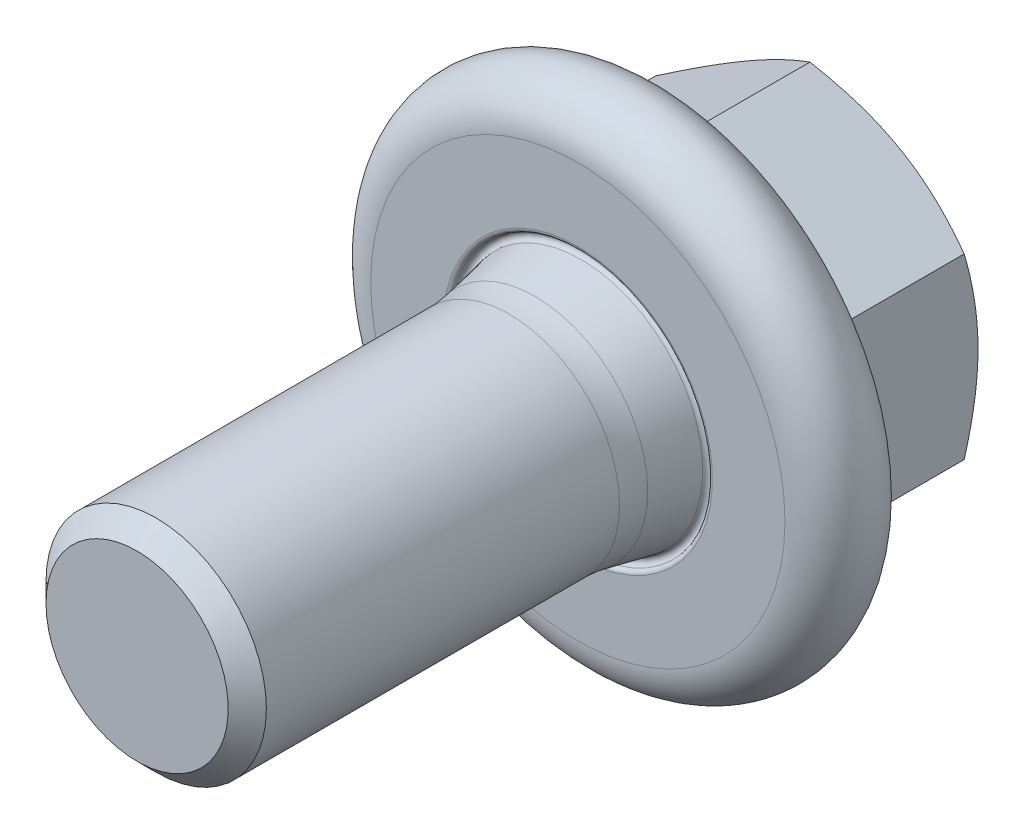
ISO-10303-21;
HEADER;
FILE_DESCRIPTION(('STEP AP214'),'2;1');
FILE_NAME('part.step','',(''),(''),'','','');
FILE_SCHEMA(('AUTOMOTIVE_DESIGN { 1 0 10303 214 1 1 1 1 }'));
ENDSEC;
DATA;
#1=APPLICATION_CONTEXT('core data for automotive mechanical design processes');
#2=APPLICATION_PROTOCOL_DEFINITION('international standard','automotive_design',2000,#1);
#3=PRODUCT_CONTEXT('',#1,'mechanical');
#4=PRODUCT('Part','Part','',(#3));
#5=PRODUCT_RELATED_PRODUCT_CATEGORY('part','',(#4));
#6=PRODUCT_DEFINITION_FORMATION('','',#4);
#7=PRODUCT_DEFINITION_CONTEXT('part definition',#1,'design');
#8=PRODUCT_DEFINITION('design','',#6,#7);
#9=PRODUCT_DEFINITION_SHAPE('','',#8);
#10=(LENGTH_UNIT() NAMED_UNIT(*) SI_UNIT(.MILLI.,.METRE.));
#11=(NAMED_UNIT(*) PLANE_ANGLE_UNIT() SI_UNIT($,.RADIAN.));
#12=(NAMED_UNIT(*) SI_UNIT($,.STERADIAN.) SOLID_ANGLE_UNIT());
#13=UNCERTAINTY_MEASURE_WITH_UNIT(LENGTH_MEASURE(1.E-05),#10,'distance_accuracy_value','');
#14=(GEOMETRIC_REPRESENTATION_CONTEXT(3) GLOBAL_UNCERTAINTY_ASSIGNED_CONTEXT((#13)) GLOBAL_UNIT_ASSIGNED_CONTEXT((#10,
#11,#12)) REPRESENTATION_CONTEXT('',''));
#15=CARTESIAN_POINT('',(0.,0.,0.));
#16=DIRECTION('',(0.,0.,1.));
#17=DIRECTION('',(1.,0.,0.));
#18=AXIS2_PLACEMENT_3D('',#15,#16,#17);
#19=CARTESIAN_POINT('',(241.672364397832,223.144870532736,-56.8712423991404));
#20=DIRECTION('',(-0.5,0.866025403784439,0.));
#21=DIRECTION('',(-0.866025403784439,-0.5,0.));
#22=AXIS2_PLACEMENT_3D('',#19,#20,#21);
#23=PLANE('',#22);
#24=CARTESIAN_POINT('',(243.422364397832,224.155233503818,-55.8751120835531));
#25=CARTESIAN_POINT('',(243.277421681038,224.07155078726,-55.9055801190428));
#26=CARTESIAN_POINT('',(243.132001035496,223.98759213841,-55.933295966667));
#27=CARTESIAN_POINT('',(242.840214294002,223.819128984663,-55.9820575852273));
#28=CARTESIAN_POINT('',(242.693847549201,223.734624105151,-56.0030981378447));
#29=CARTESIAN_POINT('',(242.40179278474,223.566006208272,-56.0371305831336));
#30=CARTESIAN_POINT('',(242.256111433559,223.481897040951,-56.0501966988537));
#31=CARTESIAN_POINT('',(241.964408088679,223.313482036261,-56.0677220203163));
#32=CARTESIAN_POINT('',(241.818386243255,223.229176284499,-56.0721844527356));
#33=CARTESIAN_POINT('',(241.526342552409,223.060564780973,-56.0721844527356));
#34=CARTESIAN_POINT('',(241.380320706985,222.97625902921,-56.0677220203164));
#35=CARTESIAN_POINT('',(241.088617362105,222.807844024521,-56.0501966988537));
#36=CARTESIAN_POINT('',(240.942936010924,222.7237348572,-56.0371305831336));
#37=CARTESIAN_POINT('',(240.650881246463,222.555116960321,-56.0030981378448));
#38=CARTESIAN_POINT('',(240.504514501662,222.470612080809,-55.9820575852274));
#39=CARTESIAN_POINT('',(240.212727760168,222.302148927062,-55.9332959666671));
#40=CARTESIAN_POINT('',(240.067307114626,222.218190278212,-55.9055801190429));
#41=CARTESIAN_POINT('',(239.922364397832,222.134507561654,-55.8751120835531));
#42=B_SPLINE_CURVE_WITH_KNOTS('',3,(#24,#25,#26,#27,#28,#29,#30,#31,#32,#33,#34,#35,#36,#37,#38,
#39,#40,#41),.UNSPECIFIED.,.F.,.F.,(4,2,2,2,2,2,2,2,4),(0.,0.51040094831921,1.02119991788177,
1.52716902069214,2.03294833077726,2.53872764086244,3.04469674367278,3.55549571323536,
4.06589666155457),.UNSPECIFIED.);
#43=CARTESIAN_POINT('',(243.422364397832,224.155233503818,-55.875112083553));
#44=VERTEX_POINT('',#43);
#45=CARTESIAN_POINT('',(239.922364397832,222.134507561654,-55.8751120835532));
#46=VERTEX_POINT('',#45);
#47=EDGE_CURVE('E41',#44,#46,#42,.T.);
#48=ORIENTED_EDGE('',*,*,#47,.F.);
#49=DIRECTION('',(0.,0.,-1.));
#50=VECTOR('',#49,1.);
#51=CARTESIAN_POINT('',(243.422364397832,224.155233503818,-54.5712423991404));
#52=LINE('',#51,#50);
#53=CARTESIAN_POINT('',(243.422364397832,224.155233503818,-58.8384277485488));
#54=VERTEX_POINT('',#53);
#55=EDGE_CURVE('E11',#44,#54,#52,.T.);
#56=ORIENTED_EDGE('',*,*,#55,.T.);
#57=CARTESIAN_POINT('',(243.422364397832,224.155233503818,-58.8384277485489));
#58=CARTESIAN_POINT('',(243.268560594597,224.066434836618,-58.8897105445773));
#59=CARTESIAN_POINT('',(243.11342915912,223.976869660585,-58.9363495636235));
#60=CARTESIAN_POINT('',(242.800480291131,223.796188547409,-59.0177565705984));
#61=CARTESIAN_POINT('',(242.642657299934,223.705069400957,-59.0524957629572));
#62=CARTESIAN_POINT('',(242.328967138754,223.523960301958,-59.1065698203933));
#63=CARTESIAN_POINT('',(242.173148220503,223.433998207561,-59.1262646202544));
#64=CARTESIAN_POINT('',(241.860777587023,223.253650938235,-59.1497717043207));
#65=CARTESIAN_POINT('',(241.704227006398,223.163266418368,-59.1536034590941));
#66=CARTESIAN_POINT('',(241.41172904084,222.994392639216,-59.1456117407781));
#67=CARTESIAN_POINT('',(241.275737764205,222.915878039044,-59.1357504994205));
#68=CARTESIAN_POINT('',(241.004641149744,222.759360335708,-59.1045024722922));
#69=CARTESIAN_POINT('',(240.869536748868,222.681357773494,-59.0831050227038));
#70=CARTESIAN_POINT('',(240.597881649814,222.524517628928,-59.0296155402069));
#71=CARTESIAN_POINT('',(240.461365315911,222.4456998868,-58.997296874667));
#72=CARTESIAN_POINT('',(240.190368200323,222.289239629166,-58.9239471670801));
#73=CARTESIAN_POINT('',(240.055883949531,222.21159511077,-58.8829333482326));
#74=CARTESIAN_POINT('',(239.922364397832,222.134507561654,-58.838427748549));
#75=B_SPLINE_CURVE_WITH_KNOTS('',3,(#57,#58,#59,#60,#61,#62,#63,#64,#65,#66,#67,#68,#69,#70,#71,
#72,#73,#74),.UNSPECIFIED.,.F.,.F.,(4,2,2,2,2,2,2,2,4),(0.,0.55477802022457,1.11088917979753,
1.65323831076775,2.19492155557138,2.666488619606,3.1384923391404,3.62096283935536,
4.10248645365132),.UNSPECIFIED.);
#76=CARTESIAN_POINT('',(239.922364397832,222.134507561654,-58.838427748549));
#77=VERTEX_POINT('',#76);
#78=EDGE_CURVE('E33',#54,#77,#75,.T.);
#79=ORIENTED_EDGE('',*,*,#78,.T.);
#80=DIRECTION('',(0.,0.,-1.));
#81=VECTOR('',#80,1.);
#82=CARTESIAN_POINT('',(239.922364397832,222.134507561654,-54.5712423991404));
#83=LINE('',#82,#81);
#84=EDGE_CURVE('E148',#46,#77,#83,.T.);
#85=ORIENTED_EDGE('',*,*,#84,.F.);
#86=EDGE_LOOP('',(#48,#56,#79,#85));
#87=FACE_BOUND('',#86,.T.);
#88=ADVANCED_FACE('F17',(#87),#23,.T.);
#89=CARTESIAN_POINT('',(239.922364397832,220.11378161949,-56.8712423991404));
#90=DIRECTION('',(-1.,0.,0.));
#91=DIRECTION('',(0.,-1.,0.));
#92=AXIS2_PLACEMENT_3D('',#89,#90,#91);
#93=PLANE('',#92);
#94=CARTESIAN_POINT('',(239.922364397832,222.134507561654,-55.8751120835532));
#95=CARTESIAN_POINT('',(239.922364397832,221.967142128538,-55.9055801190429));
#96=CARTESIAN_POINT('',(239.922364397832,221.799224830839,-55.9332959666672));
#97=CARTESIAN_POINT('',(239.922364397832,221.462298523344,-55.9820575852274));
#98=CARTESIAN_POINT('',(239.922364397832,221.293288764321,-56.0030981378448));
#99=CARTESIAN_POINT('',(239.922364397832,220.956052970562,-56.0371305831337));
#100=CARTESIAN_POINT('',(239.922364397832,220.787834635921,-56.0501966988538));
#101=CARTESIAN_POINT('',(239.922364397832,220.451004626542,-56.0677220203165));
#102=CARTESIAN_POINT('',(239.922364397832,220.282393123016,-56.0721844527357));
#103=CARTESIAN_POINT('',(239.922364397832,219.945170115965,-56.0721844527358));
#104=CARTESIAN_POINT('',(239.922364397832,219.77655861244,-56.0677220203165));
#105=CARTESIAN_POINT('',(239.922364397832,219.43972860306,-56.0501966988539));
#106=CARTESIAN_POINT('',(239.922364397832,219.271510268419,-56.0371305831338));
#107=CARTESIAN_POINT('',(239.922364397832,218.93427447466,-56.003098137845));
#108=CARTESIAN_POINT('',(239.922364397832,218.765264715637,-55.9820575852276));
#109=CARTESIAN_POINT('',(239.922364397832,218.428338408142,-55.9332959666673));
#110=CARTESIAN_POINT('',(239.922364397832,218.260421110443,-55.9055801190431));
#111=CARTESIAN_POINT('',(239.922364397832,218.093055677327,-55.8751120835534));
#112=B_SPLINE_CURVE_WITH_KNOTS('',3,(#94,#95,#96,#97,#98,#99,#100,#101,#102,#103,#104,#105,#106,
#107,#108,#109,#110,#111),.UNSPECIFIED.,.F.,.F.,(4,2,2,2,2,2,2,2,4),(0.,0.510400948319135,
1.02119991788164,1.52716902069194,2.03294833077701,2.53872764086205,3.04469674367237,
3.55549571323487,4.06589666155403),.UNSPECIFIED.);
#113=CARTESIAN_POINT('',(239.922364397832,218.093055677327,-55.8751120835534));
#114=VERTEX_POINT('',#113);
#115=EDGE_CURVE('E255',#46,#114,#112,.T.);
#116=ORIENTED_EDGE('',*,*,#115,.F.);
#117=ORIENTED_EDGE('',*,*,#84,.T.);
#118=CARTESIAN_POINT('',(239.922364397832,222.134507561654,-58.8384277485491));
#119=CARTESIAN_POINT('',(239.922364397832,221.956910227253,-58.8897105445775));
#120=CARTESIAN_POINT('',(239.922364397832,221.777779875189,-58.9363495636237));
#121=CARTESIAN_POINT('',(239.922364397832,221.416417648837,-59.0177565705986));
#122=CARTESIAN_POINT('',(239.922364397832,221.234179355933,-59.0524957629575));
#123=CARTESIAN_POINT('',(239.922364397832,220.871961157934,-59.1065698203935));
#124=CARTESIAN_POINT('',(239.922364397832,220.69203696914,-59.1262646202546));
#125=CARTESIAN_POINT('',(239.922364397832,220.331342430487,-59.1497717043209));
#126=CARTESIAN_POINT('',(239.922364397832,220.150573390755,-59.1536034590943));
#127=CARTESIAN_POINT('',(239.922364397832,219.812825832451,-59.1456117407783));
#128=CARTESIAN_POINT('',(239.922364397832,219.655796632106,-59.1357504994208));
#129=CARTESIAN_POINT('',(239.922364397832,219.342761225434,-59.1045024722925));
#130=CARTESIAN_POINT('',(239.922364397832,219.186756101006,-59.0831050227041));
#131=CARTESIAN_POINT('',(239.922364397832,218.873075811875,-59.0296155402072));
#132=CARTESIAN_POINT('',(239.922364397832,218.715440327619,-58.9972968746672));
#133=CARTESIAN_POINT('',(239.922364397832,218.402519812351,-58.9239471670804));
#134=CARTESIAN_POINT('',(239.922364397832,218.247230775558,-58.882933348233));
#135=CARTESIAN_POINT('',(239.922364397832,218.093055677327,-58.8384277485493));
#136=B_SPLINE_CURVE_WITH_KNOTS('',3,(#118,#119,#120,#121,#122,#123,#124,#125,#126,#127,#128,
#129,#130,#131,#132,#133,#134,#135),.UNSPECIFIED.,.F.,.F.,(4,2,2,2,2,2,2,2,4),(0.,
0.554778020224541,1.11088917979754,1.65323831076774,2.19492155557138,2.66648861960586,
3.13849233914015,3.62096283935494,4.10248645365079),.UNSPECIFIED.);
#137=CARTESIAN_POINT('',(239.922364397832,218.093055677327,-58.8384277485494));
#138=VERTEX_POINT('',#137);
#139=EDGE_CURVE('E150',#77,#138,#136,.T.);
#140=ORIENTED_EDGE('',*,*,#139,.T.);
#141=DIRECTION('',(0.,0.,-1.));
#142=VECTOR('',#141,1.);
#143=CARTESIAN_POINT('',(239.922364397832,218.093055677327,-54.5712423991404));
#144=LINE('',#143,#142);
#145=EDGE_CURVE('E159',#114,#138,#144,.T.);
#146=ORIENTED_EDGE('',*,*,#145,.F.);
#147=EDGE_LOOP('',(#116,#117,#140,#146));
#148=FACE_BOUND('',#147,.T.);
#149=ADVANCED_FACE('F260',(#148),#93,.T.);
#150=CARTESIAN_POINT('',(241.672364397832,217.082692706245,-56.8712423991404));
#151=DIRECTION('',(-0.5,-0.866025403784439,0.));
#152=DIRECTION('',(0.866025403784439,-0.5,0.));
#153=AXIS2_PLACEMENT_3D('',#150,#151,#152);
#154=PLANE('',#153);
#155=CARTESIAN_POINT('',(239.922364397832,218.093055677327,-55.8751120835533));
#156=CARTESIAN_POINT('',(240.067307114626,218.009372960769,-55.9055801190431));
#157=CARTESIAN_POINT('',(240.212727760168,217.925414311919,-55.9332959666673));
#158=CARTESIAN_POINT('',(240.504514501662,217.756951158172,-55.9820575852276));
#159=CARTESIAN_POINT('',(240.650881246463,217.67244627866,-56.003098137845));
#160=CARTESIAN_POINT('',(240.942936010924,217.503828381781,-56.0371305831339));
#161=CARTESIAN_POINT('',(241.088617362105,217.41971921446,-56.050196698854));
#162=CARTESIAN_POINT('',(241.380320706985,217.251304209771,-56.0677220203167));
#163=CARTESIAN_POINT('',(241.526342552409,217.166998458008,-56.0721844527359));
#164=CARTESIAN_POINT('',(241.818386243255,216.998386954482,-56.0721844527359));
#165=CARTESIAN_POINT('',(241.964408088679,216.91408120272,-56.0677220203167));
#166=CARTESIAN_POINT('',(242.256111433559,216.74566619803,-56.050196698854));
#167=CARTESIAN_POINT('',(242.40179278474,216.661557030709,-56.0371305831339));
#168=CARTESIAN_POINT('',(242.693847549201,216.49293913383,-56.0030981378451));
#169=CARTESIAN_POINT('',(242.840214294002,216.408434254318,-55.9820575852277));
#170=CARTESIAN_POINT('',(243.132001035496,216.239971100571,-55.9332959666674));
#171=CARTESIAN_POINT('',(243.277421681038,216.156012451721,-55.9055801190432));
#172=CARTESIAN_POINT('',(243.422364397832,216.072329735163,-55.8751120835534));
#173=B_SPLINE_CURVE_WITH_KNOTS('',3,(#155,#156,#157,#158,#159,#160,#161,#162,#163,#164,#165,
#166,#167,#168,#169,#170,#171,#172),.UNSPECIFIED.,.F.,.F.,(4,2,2,2,2,2,2,2,4),(0.,
0.510400948319224,1.02119991788179,1.52716902069215,2.03294833077728,2.53872764086245,
3.0446967436728,3.55549571323538,4.06589666155458),.UNSPECIFIED.);
#174=CARTESIAN_POINT('',(243.422364397832,216.072329735163,-55.8751120835534));
#175=VERTEX_POINT('',#174);
#176=EDGE_CURVE('E228',#114,#175,#173,.T.);
#177=ORIENTED_EDGE('',*,*,#176,.F.);
#178=ORIENTED_EDGE('',*,*,#145,.T.);
#179=CARTESIAN_POINT('',(239.922364397832,218.093055677327,-58.8384277485493));
#180=CARTESIAN_POINT('',(240.076168201067,218.004257010127,-58.8897105445777));
#181=CARTESIAN_POINT('',(240.231299636544,217.914691834094,-58.9363495636239));
#182=CARTESIAN_POINT('',(240.544248504533,217.734010720918,-59.0177565705989));
#183=CARTESIAN_POINT('',(240.70207149573,217.642891574466,-59.0524957629577));
#184=CARTESIAN_POINT('',(241.01576165691,217.461782475467,-59.1065698203938));
#185=CARTESIAN_POINT('',(241.171580575161,217.37182038107,-59.1262646202548));
#186=CARTESIAN_POINT('',(241.48395120864,217.191473111744,-59.1497717043212));
#187=CARTESIAN_POINT('',(241.640501789266,217.101088591878,-59.1536034590946));
#188=CARTESIAN_POINT('',(241.932999754824,216.932214812726,-59.1456117407786));
#189=CARTESIAN_POINT('',(242.068991031459,216.853700212553,-59.135750499421));
#190=CARTESIAN_POINT('',(242.34008764592,216.697182509217,-59.1045024722927));
#191=CARTESIAN_POINT('',(242.475192046796,216.619179947003,-59.0831050227043));
#192=CARTESIAN_POINT('',(242.74684714585,216.462339802437,-59.0296155402074));
#193=CARTESIAN_POINT('',(242.883363479753,216.383522060309,-58.9972968746674));
#194=CARTESIAN_POINT('',(243.154360595341,216.227061802675,-58.9239471670806));
#195=CARTESIAN_POINT('',(243.288844846133,216.149417284279,-58.8829333482331));
#196=CARTESIAN_POINT('',(243.422364397832,216.072329735163,-58.8384277485494));
#197=B_SPLINE_CURVE_WITH_KNOTS('',3,(#179,#180,#181,#182,#183,#184,#185,#186,#187,#188,#189,
#190,#191,#192,#193,#194,#195,#196),.UNSPECIFIED.,.F.,.F.,(4,2,2,2,2,2,2,2,4),(0.,
0.554778020224543,1.11088917979746,1.6532383107676,2.19492155557119,2.66648861960582,
3.13849233914029,3.62096283935528,4.10248645365136),.UNSPECIFIED.);
#198=CARTESIAN_POINT('',(243.422364397832,216.072329735163,-58.8384277485494));
#199=VERTEX_POINT('',#198);
#200=EDGE_CURVE('E158',#138,#199,#197,.T.);
#201=ORIENTED_EDGE('',*,*,#200,.T.);
#202=DIRECTION('',(0.,0.,-1.));
#203=VECTOR('',#202,1.);
#204=CARTESIAN_POINT('',(243.422364397832,216.072329735163,-54.5712423991404));
#205=LINE('',#204,#203);
#206=EDGE_CURVE('E156',#175,#199,#205,.T.);
#207=ORIENTED_EDGE('',*,*,#206,.F.);
#208=EDGE_LOOP('',(#177,#178,#201,#207));
#209=FACE_BOUND('',#208,.T.);
#210=ADVANCED_FACE('F219',(#209),#154,.T.);
#211=CARTESIAN_POINT('',(245.172364397832,217.082692706245,-56.8712423991404));
#212=DIRECTION('',(0.5,-0.866025403784439,0.));
#213=DIRECTION('',(0.866025403784439,0.5,0.));
#214=AXIS2_PLACEMENT_3D('',#211,#212,#213);
#215=PLANE('',#214);
#216=CARTESIAN_POINT('',(243.422364397832,216.072329735163,-55.8751120835534));
#217=CARTESIAN_POINT('',(243.567307114626,216.156012451721,-55.9055801190432));
#218=CARTESIAN_POINT('',(243.712727760168,216.239971100571,-55.9332959666674));
#219=CARTESIAN_POINT('',(244.004514501662,216.408434254318,-55.9820575852277));
#220=CARTESIAN_POINT('',(244.150881246463,216.49293913383,-56.0030981378451));
#221=CARTESIAN_POINT('',(244.442936010924,216.661557030709,-56.0371305831339));
#222=CARTESIAN_POINT('',(244.588617362105,216.74566619803,-56.050196698854));
#223=CARTESIAN_POINT('',(244.880320706985,216.91408120272,-56.0677220203167));
#224=CARTESIAN_POINT('',(245.026342552409,216.998386954482,-56.0721844527359));
#225=CARTESIAN_POINT('',(245.318386243255,217.166998458008,-56.0721844527359));
#226=CARTESIAN_POINT('',(245.464408088679,217.251304209771,-56.0677220203167));
#227=CARTESIAN_POINT('',(245.756111433559,217.41971921446,-56.050196698854));
#228=CARTESIAN_POINT('',(245.90179278474,217.503828381781,-56.0371305831339));
#229=CARTESIAN_POINT('',(246.193847549201,217.67244627866,-56.003098137845));
#230=CARTESIAN_POINT('',(246.340214294002,217.756951158172,-55.9820575852276));
#231=CARTESIAN_POINT('',(246.632001035496,217.925414311919,-55.9332959666673));
#232=CARTESIAN_POINT('',(246.777421681038,218.009372960769,-55.9055801190431));
#233=CARTESIAN_POINT('',(246.922364397832,218.093055677327,-55.8751120835533));
#234=B_SPLINE_CURVE_WITH_KNOTS('',3,(#216,#217,#218,#219,#220,#221,#222,#223,#224,#225,#226,
#227,#228,#229,#230,#231,#232,#233),.UNSPECIFIED.,.F.,.F.,(4,2,2,2,2,2,2,2,4),(0.,
0.510400948319207,1.02119991788178,1.52716902069213,2.0329483307773,2.53872764086243,
3.04469674367279,3.55549571323536,4.06589666155458),.UNSPECIFIED.);
#235=CARTESIAN_POINT('',(246.922364397832,218.093055677327,-55.8751120835534));
#236=VERTEX_POINT('',#235);
#237=EDGE_CURVE('E64',#175,#236,#234,.T.);
#238=ORIENTED_EDGE('',*,*,#237,.F.);
#239=ORIENTED_EDGE('',*,*,#206,.T.);
#240=CARTESIAN_POINT('',(243.422364397832,216.072329735163,-58.8384277485494));
#241=CARTESIAN_POINT('',(243.576168201067,216.161128402363,-58.8897105445778));
#242=CARTESIAN_POINT('',(243.731299636544,216.250693578396,-58.9363495636241));
#243=CARTESIAN_POINT('',(244.044248504533,216.431374691571,-59.017756570599));
#244=CARTESIAN_POINT('',(244.20207149573,216.522493838024,-59.0524957629578));
#245=CARTESIAN_POINT('',(244.51576165691,216.703602937023,-59.1065698203938));
#246=CARTESIAN_POINT('',(244.67158057516,216.79356503142,-59.1262646202549));
#247=CARTESIAN_POINT('',(244.98395120864,216.973912300746,-59.1497717043212));
#248=CARTESIAN_POINT('',(245.140501789266,217.064296820612,-59.1536034590946));
#249=CARTESIAN_POINT('',(245.432999754824,217.233170599764,-59.1456117407786));
#250=CARTESIAN_POINT('',(245.568991031458,217.311685199937,-59.135750499421));
#251=CARTESIAN_POINT('',(245.84008764592,217.468202903273,-59.1045024722927));
#252=CARTESIAN_POINT('',(245.975192046796,217.546205465487,-59.0831050227043));
#253=CARTESIAN_POINT('',(246.24684714585,217.703045610053,-59.0296155402073));
#254=CARTESIAN_POINT('',(246.383363479753,217.78186335218,-58.9972968746673));
#255=CARTESIAN_POINT('',(246.654360595341,217.938323609815,-58.9239471670805));
#256=CARTESIAN_POINT('',(246.788844846133,218.015968128211,-58.882933348233));
#257=CARTESIAN_POINT('',(246.922364397832,218.093055677327,-58.8384277485493));
#258=B_SPLINE_CURVE_WITH_KNOTS('',3,(#240,#241,#242,#243,#244,#245,#246,#247,#248,#249,#250,
#251,#252,#253,#254,#255,#256,#257),.UNSPECIFIED.,.F.,.F.,(4,2,2,2,2,2,2,2,4),(0.,
0.554778020224408,1.11088917979724,1.6532383107673,2.19492155557072,2.6664886196055,
3.13849233914005,3.62096283935517,4.10248645365136),.UNSPECIFIED.);
#259=CARTESIAN_POINT('',(246.922364397832,218.093055677327,-58.8384277485493));
#260=VERTEX_POINT('',#259);
#261=EDGE_CURVE('E155',#199,#260,#258,.T.);
#262=ORIENTED_EDGE('',*,*,#261,.T.);
#263=DIRECTION('',(0.,0.,-1.));
#264=VECTOR('',#263,1.);
#265=CARTESIAN_POINT('',(246.922364397832,218.093055677327,-54.5712423991404));
#266=LINE('',#265,#264);
#267=EDGE_CURVE('E153',#236,#260,#266,.T.);
#268=ORIENTED_EDGE('',*,*,#267,.F.);
#269=EDGE_LOOP('',(#238,#239,#262,#268));
#270=FACE_BOUND('',#269,.T.);
#271=ADVANCED_FACE('F214',(#270),#215,.T.);
#272=CARTESIAN_POINT('',(246.922364397832,220.11378161949,-56.8712423991404));
#273=DIRECTION('',(1.,0.,0.));
#274=DIRECTION('',(0.,1.,0.));
#275=AXIS2_PLACEMENT_3D('',#272,#273,#274);
#276=PLANE('',#275);
#277=CARTESIAN_POINT('',(246.922364397832,218.093055677327,-55.8751120835534));
#278=CARTESIAN_POINT('',(246.922364397832,218.260421110443,-55.9055801190431));
#279=CARTESIAN_POINT('',(246.922364397832,218.428338408142,-55.9332959666673));
#280=CARTESIAN_POINT('',(246.922364397832,218.765264715637,-55.9820575852276));
#281=CARTESIAN_POINT('',(246.922364397832,218.93427447466,-56.003098137845));
#282=CARTESIAN_POINT('',(246.922364397832,219.271510268419,-56.0371305831338));
#283=CARTESIAN_POINT('',(246.922364397832,219.43972860306,-56.0501966988539));
#284=CARTESIAN_POINT('',(246.922364397832,219.77655861244,-56.0677220203165));
#285=CARTESIAN_POINT('',(246.922364397832,219.945170115965,-56.0721844527358));
#286=CARTESIAN_POINT('',(246.922364397832,220.282393123016,-56.0721844527357));
#287=CARTESIAN_POINT('',(246.922364397832,220.451004626542,-56.0677220203165));
#288=CARTESIAN_POINT('',(246.922364397832,220.787834635921,-56.0501966988538));
#289=CARTESIAN_POINT('',(246.922364397832,220.956052970562,-56.0371305831337));
#290=CARTESIAN_POINT('',(246.922364397832,221.293288764321,-56.0030981378448));
#291=CARTESIAN_POINT('',(246.922364397832,221.462298523344,-55.9820575852274));
#292=CARTESIAN_POINT('',(246.922364397832,221.799224830839,-55.9332959666672));
#293=CARTESIAN_POINT('',(246.922364397832,221.967142128538,-55.9055801190429));
#294=CARTESIAN_POINT('',(246.922364397832,222.134507561654,-55.8751120835532));
#295=B_SPLINE_CURVE_WITH_KNOTS('',3,(#277,#278,#279,#280,#281,#282,#283,#284,#285,#286,#287,
#288,#289,#290,#291,#292,#293,#294),.UNSPECIFIED.,.F.,.F.,(4,2,2,2,2,2,2,2,4),(0.,
0.510400948319099,1.02119991788166,1.52716902069197,2.03294833077702,2.53872764086209,
3.04469674367238,3.55549571323489,4.06589666155403),.UNSPECIFIED.);
#296=CARTESIAN_POINT('',(246.922364397832,222.134507561654,-55.8751120835532));
#297=VERTEX_POINT('',#296);
#298=EDGE_CURVE('E21',#236,#297,#295,.T.);
#299=ORIENTED_EDGE('',*,*,#298,.F.);
#300=ORIENTED_EDGE('',*,*,#267,.T.);
#301=CARTESIAN_POINT('',(246.922364397832,218.093055677327,-58.8384277485493));
#302=CARTESIAN_POINT('',(246.922364397832,218.270653011728,-58.8897105445777));
#303=CARTESIAN_POINT('',(246.922364397832,218.449783363792,-58.9363495636239));
#304=CARTESIAN_POINT('',(246.922364397832,218.811145590144,-59.0177565705988));
#305=CARTESIAN_POINT('',(246.922364397832,218.993383883048,-59.0524957629576));
#306=CARTESIAN_POINT('',(246.922364397832,219.355602081047,-59.1065698203936));
#307=CARTESIAN_POINT('',(246.922364397832,219.53552626984,-59.1262646202546));
#308=CARTESIAN_POINT('',(246.922364397832,219.896220808493,-59.1497717043209));
#309=CARTESIAN_POINT('',(246.922364397832,220.076989848225,-59.1536034590943));
#310=CARTESIAN_POINT('',(246.922364397832,220.41473740653,-59.1456117407783));
#311=CARTESIAN_POINT('',(246.922364397832,220.571766606875,-59.1357504994207));
#312=CARTESIAN_POINT('',(246.922364397832,220.884802013546,-59.1045024722924));
#313=CARTESIAN_POINT('',(246.922364397832,221.040807137975,-59.083105022704));
#314=CARTESIAN_POINT('',(246.922364397832,221.354487427106,-59.029615540207));
#315=CARTESIAN_POINT('',(246.922364397832,221.512122911362,-58.9972968746671));
#316=CARTESIAN_POINT('',(246.922364397832,221.825043426629,-58.9239471670802));
#317=CARTESIAN_POINT('',(246.922364397832,221.980332463423,-58.8829333482327));
#318=CARTESIAN_POINT('',(246.922364397832,222.134507561654,-58.8384277485491));
#319=B_SPLINE_CURVE_WITH_KNOTS('',3,(#301,#302,#303,#304,#305,#306,#307,#308,#309,#310,#311,
#312,#313,#314,#315,#316,#317,#318),.UNSPECIFIED.,.F.,.F.,(4,2,2,2,2,2,2,2,4),(0.,
0.554778020224406,1.11088917979725,1.65323831076733,2.19492155557084,2.66648861960546,
3.13849233913984,3.62096283935481,4.10248645365079),.UNSPECIFIED.);
#320=CARTESIAN_POINT('',(246.922364397832,222.134507561654,-58.8384277485491));
#321=VERTEX_POINT('',#320);
#322=EDGE_CURVE('E152',#260,#321,#319,.T.);
#323=ORIENTED_EDGE('',*,*,#322,.T.);
#324=DIRECTION('',(0.,0.,-1.));
#325=VECTOR('',#324,1.);
#326=CARTESIAN_POINT('',(246.922364397832,222.134507561654,-54.5712423991404));
#327=LINE('',#326,#325);
#328=EDGE_CURVE('E73',#297,#321,#327,.T.);
#329=ORIENTED_EDGE('',*,*,#328,.F.);
#330=EDGE_LOOP('',(#299,#300,#323,#329));
#331=FACE_BOUND('',#330,.T.);
#332=ADVANCED_FACE('F211',(#331),#276,.T.);
#333=CARTESIAN_POINT('',(245.172364397832,223.144870532736,-56.8712423991404));
#334=DIRECTION('',(0.5,0.866025403784439,0.));
#335=DIRECTION('',(-0.866025403784439,0.5,0.));
#336=AXIS2_PLACEMENT_3D('',#333,#334,#335);
#337=PLANE('',#336);
#338=CARTESIAN_POINT('',(246.922364397832,222.134507561654,-55.8751120835531));
#339=CARTESIAN_POINT('',(246.777421681038,222.218190278212,-55.9055801190429));
#340=CARTESIAN_POINT('',(246.632001035496,222.302148927062,-55.9332959666671));
#341=CARTESIAN_POINT('',(246.340214294002,222.470612080809,-55.9820575852274));
#342=CARTESIAN_POINT('',(246.193847549201,222.555116960321,-56.0030981378448));
#343=CARTESIAN_POINT('',(245.90179278474,222.7237348572,-56.0371305831336));
#344=CARTESIAN_POINT('',(245.756111433559,222.807844024521,-56.0501966988537));
#345=CARTESIAN_POINT('',(245.464408088679,222.97625902921,-56.0677220203164));
#346=CARTESIAN_POINT('',(245.318386243255,223.060564780973,-56.0721844527356));
#347=CARTESIAN_POINT('',(245.026342552409,223.229176284499,-56.0721844527356));
#348=CARTESIAN_POINT('',(244.880320706985,223.313482036261,-56.0677220203163));
#349=CARTESIAN_POINT('',(244.588617362105,223.481897040951,-56.0501966988537));
#350=CARTESIAN_POINT('',(244.442936010924,223.566006208272,-56.0371305831336));
#351=CARTESIAN_POINT('',(244.150881246463,223.734624105151,-56.0030981378447));
#352=CARTESIAN_POINT('',(244.004514501662,223.819128984663,-55.9820575852273));
#353=CARTESIAN_POINT('',(243.712727760168,223.98759213841,-55.933295966667));
#354=CARTESIAN_POINT('',(243.567307114626,224.07155078726,-55.9055801190428));
#355=CARTESIAN_POINT('',(243.422364397832,224.155233503818,-55.8751120835531));
#356=B_SPLINE_CURVE_WITH_KNOTS('',3,(#338,#339,#340,#341,#342,#343,#344,#345,#346,#347,#348,
#349,#350,#351,#352,#353,#354,#355),.UNSPECIFIED.,.F.,.F.,(4,2,2,2,2,2,2,2,4),(0.,
0.510400948319208,1.02119991788178,1.52716902069213,2.0329483307773,2.53872764086243,
3.04469674367279,3.55549571323536,4.06589666155457),.UNSPECIFIED.);
#357=EDGE_CURVE('E121',#297,#44,#356,.T.);
#358=ORIENTED_EDGE('',*,*,#357,.F.);
#359=ORIENTED_EDGE('',*,*,#328,.T.);
#360=CARTESIAN_POINT('',(246.922364397832,222.134507561654,-58.838427748549));
#361=CARTESIAN_POINT('',(246.768560594597,222.223306228854,-58.8897105445774));
#362=CARTESIAN_POINT('',(246.61342915912,222.312871404887,-58.9363495636236));
#363=CARTESIAN_POINT('',(246.300480291131,222.493552518063,-59.0177565705985));
#364=CARTESIAN_POINT('',(246.142657299934,222.584671664515,-59.0524957629573));
#365=CARTESIAN_POINT('',(245.828967138754,222.765780763514,-59.1065698203933));
#366=CARTESIAN_POINT('',(245.673148220503,222.855742857911,-59.1262646202544));
#367=CARTESIAN_POINT('',(245.360777587023,223.036090127237,-59.1497717043207));
#368=CARTESIAN_POINT('',(245.204227006398,223.126474647104,-59.1536034590941));
#369=CARTESIAN_POINT('',(244.91172904084,223.295348426256,-59.1456117407781));
#370=CARTESIAN_POINT('',(244.775737764205,223.373863026428,-59.1357504994205));
#371=CARTESIAN_POINT('',(244.504641149744,223.530380729764,-59.1045024722921));
#372=CARTESIAN_POINT('',(244.369536748868,223.608383291978,-59.0831050227037));
#373=CARTESIAN_POINT('',(244.097881649814,223.765223436544,-59.0296155402068));
#374=CARTESIAN_POINT('',(243.961365315911,223.844041178672,-58.9972968746668));
#375=CARTESIAN_POINT('',(243.690368200323,224.000501436306,-58.92394716708));
#376=CARTESIAN_POINT('',(243.555883949531,224.078145954702,-58.8829333482325));
#377=CARTESIAN_POINT('',(243.422364397832,224.155233503818,-58.8384277485489));
#378=B_SPLINE_CURVE_WITH_KNOTS('',3,(#360,#361,#362,#363,#364,#365,#366,#367,#368,#369,#370,
#371,#372,#373,#374,#375,#376,#377),.UNSPECIFIED.,.F.,.F.,(4,2,2,2,2,2,2,2,4),(0.,
0.554778020224558,1.11088917979755,1.65323831076775,2.19492155557137,2.66648861960598,
3.1384923391404,3.62096283935535,4.10248645365132),.UNSPECIFIED.);
#379=EDGE_CURVE('E116',#321,#54,#378,.T.);
#380=ORIENTED_EDGE('',*,*,#379,.T.);
#381=ORIENTED_EDGE('',*,*,#55,.F.);
#382=EDGE_LOOP('',(#358,#359,#380,#381));
#383=FACE_BOUND('',#382,.T.);
#384=ADVANCED_FACE('F181',(#383),#337,.T.);
#385=CARTESIAN_POINT('',(243.422364397832,220.11378161949,-61.1717610818825));
#386=DIRECTION('',(0.,0.,1.));
#387=DIRECTION('',(1.,0.,0.));
#388=AXIS2_PLACEMENT_3D('',#385,#386,#387);
#389=CONICAL_SURFACE('',#388,0.,1.0471975511966);
#390=ORIENTED_EDGE('',*,*,#78,.F.);
#391=ORIENTED_EDGE('',*,*,#379,.F.);
#392=ORIENTED_EDGE('',*,*,#322,.F.);
#393=ORIENTED_EDGE('',*,*,#261,.F.);
#394=ORIENTED_EDGE('',*,*,#200,.F.);
#395=ORIENTED_EDGE('',*,*,#139,.F.);
#396=EDGE_LOOP('',(#390,#391,#392,#393,#394,#395));
#397=FACE_BOUND('',#396,.T.);
#398=CARTESIAN_POINT('',(243.422364397832,220.11378161949,-59.1712423991404));
#399=DIRECTION('',(0.,0.,-1.));
#400=DIRECTION('',(1.,0.,0.));
#401=AXIS2_PLACEMENT_3D('',#398,#399,#400);
#402=CIRCLE('',#401,3.465);
#403=CARTESIAN_POINT('',(246.887364397832,220.11378161949,-59.1712423991404));
#404=VERTEX_POINT('',#403);
#405=EDGE_CURVE('E113',#404,#404,#402,.T.);
#406=ORIENTED_EDGE('',*,*,#405,.F.);
#407=EDGE_LOOP('',(#406));
#408=FACE_BOUND('',#407,.T.);
#409=ADVANCED_FACE('F114',(#397,#408),#389,.T.);
#410=CARTESIAN_POINT('',(243.422364397832,220.11378161949,-59.1712423991404));
#411=DIRECTION('',(0.,0.,-1.));
#412=DIRECTION('',(-1.,0.,0.));
#413=AXIS2_PLACEMENT_3D('',#410,#411,#412);
#414=PLANE('',#413);
#415=ORIENTED_EDGE('',*,*,#405,.T.);
#416=EDGE_LOOP('',(#415));
#417=FACE_BOUND('',#416,.T.);
#418=ADVANCED_FACE('F180',(#417),#414,.T.);
#419=CARTESIAN_POINT('',(243.422364397832,220.11378161949,-53.5712423991404));
#420=DIRECTION('',(0.,0.,1.));
#421=DIRECTION('',(1.,0.,0.));
#422=AXIS2_PLACEMENT_3D('',#419,#420,#421);
#423=PLANE('',#422);
#424=CARTESIAN_POINT('',(243.422364397832,220.11378161949,-53.5712423991404));
#425=DIRECTION('',(0.,0.,1.));
#426=DIRECTION('',(-1.,0.,0.));
#427=AXIS2_PLACEMENT_3D('',#424,#425,#426);
#428=CIRCLE('',#427,3.05551918177834);
#429=CARTESIAN_POINT('',(240.366845216054,220.11378161949,-53.5712423991404));
#430=VERTEX_POINT('',#429);
#431=EDGE_CURVE('E124',#430,#430,#428,.T.);
#432=ORIENTED_EDGE('',*,*,#431,.F.);
#433=EDGE_LOOP('',(#432));
#434=FACE_BOUND('',#433,.T.);
#435=CARTESIAN_POINT('',(243.422364397832,220.11378161949,-53.5712423991404));
#436=DIRECTION('',(0.,0.,1.));
#437=DIRECTION('',(-1.,0.,0.));
#438=AXIS2_PLACEMENT_3D('',#435,#436,#437);
#439=CIRCLE('',#438,4.7);
#440=CARTESIAN_POINT('',(238.722364397832,220.11378161949,-53.5712423991404));
#441=VERTEX_POINT('',#440);
#442=EDGE_CURVE('E117',#441,#441,#439,.T.);
#443=ORIENTED_EDGE('',*,*,#442,.T.);
#444=EDGE_LOOP('',(#443));
#445=FACE_BOUND('',#444,.T.);
#446=ADVANCED_FACE('F239',(#434,#445),#423,.T.);
#447=CARTESIAN_POINT('',(243.422364397832,220.11378161949,-56.3712423991404));
#448=DIRECTION('',(0.,0.,1.));
#449=DIRECTION('',(1.,0.,0.));
#450=AXIS2_PLACEMENT_3D('',#447,#448,#449);
#451=CONICAL_SURFACE('',#450,2.67834504514476,1.22173047639603);
#452=ORIENTED_EDGE('',*,*,#357,.T.);
#453=ORIENTED_EDGE('',*,*,#47,.T.);
#454=ORIENTED_EDGE('',*,*,#115,.T.);
#455=ORIENTED_EDGE('',*,*,#176,.T.);
#456=ORIENTED_EDGE('',*,*,#237,.T.);
#457=ORIENTED_EDGE('',*,*,#298,.T.);
#458=EDGE_LOOP('',(#452,#453,#454,#455,#456,#457));
#459=FACE_BOUND('',#458,.T.);
#460=CARTESIAN_POINT('',(243.422364397832,220.11378161949,-55.5109350199263));
#461=DIRECTION('',(0.,0.,-1.));
#462=DIRECTION('',(1.,0.,0.));
#463=AXIS2_PLACEMENT_3D('',#460,#461,#462);
#464=CIRCLE('',#463,5.04202014332566);
#465=CARTESIAN_POINT('',(248.464384541158,220.11378161949,-55.5109350199263));
#466=VERTEX_POINT('',#465);
#467=EDGE_CURVE('E129',#466,#466,#464,.T.);
#468=ORIENTED_EDGE('',*,*,#467,.T.);
#469=EDGE_LOOP('',(#468));
#470=FACE_BOUND('',#469,.T.);
#471=ADVANCED_FACE('F234',(#459,#470),#451,.T.);
#472=CARTESIAN_POINT('',(243.422364397832,220.11378161949,-54.5712423991404));
#473=DIRECTION('',(0.,0.,1.));
#474=DIRECTION('',(1.,0.,0.));
#475=AXIS2_PLACEMENT_3D('',#472,#473,#474);
#476=TOROIDAL_SURFACE('',#475,4.7,1.);
#477=ORIENTED_EDGE('',*,*,#442,.F.);
#478=EDGE_LOOP('',(#477));
#479=FACE_BOUND('',#478,.T.);
#480=ORIENTED_EDGE('',*,*,#467,.F.);
#481=EDGE_LOOP('',(#480));
#482=FACE_BOUND('',#481,.T.);
#483=ADVANCED_FACE('F238',(#479,#482),#476,.T.);
#484=CARTESIAN_POINT('',(243.422364397832,220.11378161949,-53.6212423991404));
#485=DIRECTION('',(0.,0.,1.));
#486=DIRECTION('',(1.,0.,0.));
#487=AXIS2_PLACEMENT_3D('',#484,#485,#486);
#488=TOROIDAL_SURFACE('',#487,2.86187001446222,0.1);
#489=CARTESIAN_POINT('',(243.422364397832,220.11378161949,-53.6407042829993));
#490=DIRECTION('',(0.,0.,-1.));
#491=DIRECTION('',(-1.,0.,0.));
#492=AXIS2_PLACEMENT_3D('',#489,#490,#491);
#493=CIRCLE('',#492,2.76378211981328);
#494=CARTESIAN_POINT('',(240.658582278019,220.11378161949,-53.6407042829993));
#495=VERTEX_POINT('',#494);
#496=EDGE_CURVE('E126',#495,#495,#493,.T.);
#497=ORIENTED_EDGE('',*,*,#496,.T.);
#498=EDGE_LOOP('',(#497));
#499=FACE_BOUND('',#498,.T.);
#500=CARTESIAN_POINT('',(243.422364397832,220.11378161949,-53.6462423991411));
#501=DIRECTION('',(0.,0.,-1.));
#502=DIRECTION('',(-1.,0.,0.));
#503=AXIS2_PLACEMENT_3D('',#500,#501,#502);
#504=CIRCLE('',#503,2.95869459812297);
#505=CARTESIAN_POINT('',(240.463669799709,220.11378161949,-53.6462423991411));
#506=VERTEX_POINT('',#505);
#507=EDGE_CURVE('E127',#506,#506,#504,.T.);
#508=ORIENTED_EDGE('',*,*,#507,.F.);
#509=EDGE_LOOP('',(#508));
#510=FACE_BOUND('',#509,.T.);
#511=ADVANCED_FACE('F318',(#499,#510),#488,.F.);
#512=CARTESIAN_POINT('',(243.422364397832,220.11378161949,-53.6712423991404));
#513=DIRECTION('',(0.,0.,1.));
#514=DIRECTION('',(1.,0.,0.));
#515=AXIS2_PLACEMENT_3D('',#512,#513,#514);
#516=TOROIDAL_SURFACE('',#515,3.05551918177834,0.1);
#517=ORIENTED_EDGE('',*,*,#431,.T.);
#518=EDGE_LOOP('',(#517));
#519=FACE_BOUND('',#518,.T.);
#520=ORIENTED_EDGE('',*,*,#507,.T.);
#521=EDGE_LOOP('',(#520));
#522=FACE_BOUND('',#521,.T.);
#523=ADVANCED_FACE('F325',(#519,#522),#516,.T.);
#524=CARTESIAN_POINT('',(243.422364397832,220.11378161949,-43.5712423991404));
#525=DIRECTION('',(0.,0.,1.));
#526=DIRECTION('',(1.,0.,0.));
#527=AXIS2_PLACEMENT_3D('',#524,#525,#526);
#528=PLANE('',#527);
#529=CARTESIAN_POINT('',(243.422364397832,220.11378161949,-43.5712423991404));
#530=DIRECTION('',(0.,0.,1.));
#531=DIRECTION('',(-1.,0.,0.));
#532=AXIS2_PLACEMENT_3D('',#529,#530,#531);
#533=CIRCLE('',#532,2.0669872984);
#534=CARTESIAN_POINT('',(241.355377099432,220.11378161949,-43.5712423991404));
#535=VERTEX_POINT('',#534);
#536=EDGE_CURVE('E136',#535,#535,#533,.T.);
#537=ORIENTED_EDGE('',*,*,#536,.T.);
#538=EDGE_LOOP('',(#537));
#539=FACE_BOUND('',#538,.T.);
#540=ADVANCED_FACE('F332',(#539),#528,.T.);
#541=CARTESIAN_POINT('',(243.422364397832,220.11378161949,-52.3112423991404));
#542=DIRECTION('',(0.,0.,1.));
#543=DIRECTION('',(1.,0.,0.));
#544=AXIS2_PLACEMENT_3D('',#541,#542,#543);
#545=CYLINDRICAL_SURFACE('',#544,2.5);
#546=CARTESIAN_POINT('',(243.422364397832,220.11378161949,-44.0042551007404));
#547=DIRECTION('',(0.,0.,-1.));
#548=DIRECTION('',(-1.,0.,0.));
#549=AXIS2_PLACEMENT_3D('',#546,#547,#548);
#550=CIRCLE('',#549,2.5);
#551=CARTESIAN_POINT('',(240.922364397832,220.11378161949,-44.0042551007404));
#552=VERTEX_POINT('',#551);
#553=EDGE_CURVE('E139',#552,#552,#550,.T.);
#554=ORIENTED_EDGE('',*,*,#553,.T.);
#555=EDGE_LOOP('',(#554));
#556=FACE_BOUND('',#555,.T.);
#557=CARTESIAN_POINT('',(243.422364397832,220.11378161949,-52.0164962124528));
#558=DIRECTION('',(0.,0.,1.));
#559=DIRECTION('',(1.,0.,0.));
#560=AXIS2_PLACEMENT_3D('',#557,#558,#559);
#561=CIRCLE('',#560,2.5);
#562=CARTESIAN_POINT('',(245.922364397832,220.11378161949,-52.0164962124528));
#563=VERTEX_POINT('',#562);
#564=EDGE_CURVE('E142',#563,#563,#561,.T.);
#565=ORIENTED_EDGE('',*,*,#564,.T.);
#566=EDGE_LOOP('',(#565));
#567=FACE_BOUND('',#566,.T.);
#568=ADVANCED_FACE('F340',(#556,#567),#545,.T.);
#569=CARTESIAN_POINT('',(243.422364397832,220.11378161949,-52.3112423991404));
#570=DIRECTION('',(0.,0.,-1.));
#571=DIRECTION('',(-1.,0.,0.));
#572=AXIS2_PLACEMENT_3D('',#569,#570,#571);
#573=CONICAL_SURFACE('',#572,2.5,0.195868843478818);
#574=CARTESIAN_POINT('',(243.422364397832,220.11378161949,-52.6003527282203));
#575=DIRECTION('',(0.,0.,-1.));
#576=DIRECTION('',(1.,0.,0.));
#577=AXIS2_PLACEMENT_3D('',#574,#575,#576);
#578=CIRCLE('',#577,2.55736316053173);
#579=CARTESIAN_POINT('',(245.979727558364,220.11378161949,-52.6003527282203));
#580=VERTEX_POINT('',#579);
#581=EDGE_CURVE('E145',#580,#580,#578,.T.);
#582=ORIENTED_EDGE('',*,*,#581,.T.);
#583=EDGE_LOOP('',(#582));
#584=FACE_BOUND('',#583,.T.);
#585=ORIENTED_EDGE('',*,*,#496,.F.);
#586=EDGE_LOOP('',(#585));
#587=FACE_BOUND('',#586,.T.);
#588=ADVANCED_FACE('F348',(#584,#587),#573,.T.);
#589=CARTESIAN_POINT('',(243.422364397832,220.11378161949,-52.0164962124528));
#590=DIRECTION('',(0.,0.,-1.));
#591=DIRECTION('',(-1.,0.,0.));
#592=AXIS2_PLACEMENT_3D('',#589,#590,#591);
#593=TOROIDAL_SURFACE('',#592,5.5,3.);
#594=ORIENTED_EDGE('',*,*,#564,.F.);
#595=EDGE_LOOP('',(#594));
#596=FACE_BOUND('',#595,.T.);
#597=ORIENTED_EDGE('',*,*,#581,.F.);
#598=EDGE_LOOP('',(#597));
#599=FACE_BOUND('',#598,.T.);
#600=ADVANCED_FACE('F356',(#596,#599),#593,.F.);
#601=CARTESIAN_POINT('',(243.422364397832,220.11378161949,-44.0042551007404));
#602=DIRECTION('',(0.,0.,-1.));
#603=DIRECTION('',(-1.,0.,0.));
#604=AXIS2_PLACEMENT_3D('',#601,#602,#603);
#605=CONICAL_SURFACE('',#604,2.5,0.785398163397448);
#606=ORIENTED_EDGE('',*,*,#536,.F.);
#607=EDGE_LOOP('',(#606));
#608=FACE_BOUND('',#607,.T.);
#609=ORIENTED_EDGE('',*,*,#553,.F.);
#610=EDGE_LOOP('',(#609));
#611=FACE_BOUND('',#610,.T.);
#612=ADVANCED_FACE('F19',(#608,#611),#605,.T.);
#613=CLOSED_SHELL('',(#88,#149,#210,#271,#332,#384,#409,#418,#446,#471,#483,#511,#523,#540,#568,
#588,#600,#612));
#614=MANIFOLD_SOLID_BREP('B1',#613);
#615=ADVANCED_BREP_SHAPE_REPRESENTATION('',(#18,#614),#14);
#616=SHAPE_DEFINITION_REPRESENTATION(#9,#615);
ENDSEC;
END-ISO-10303-21;
